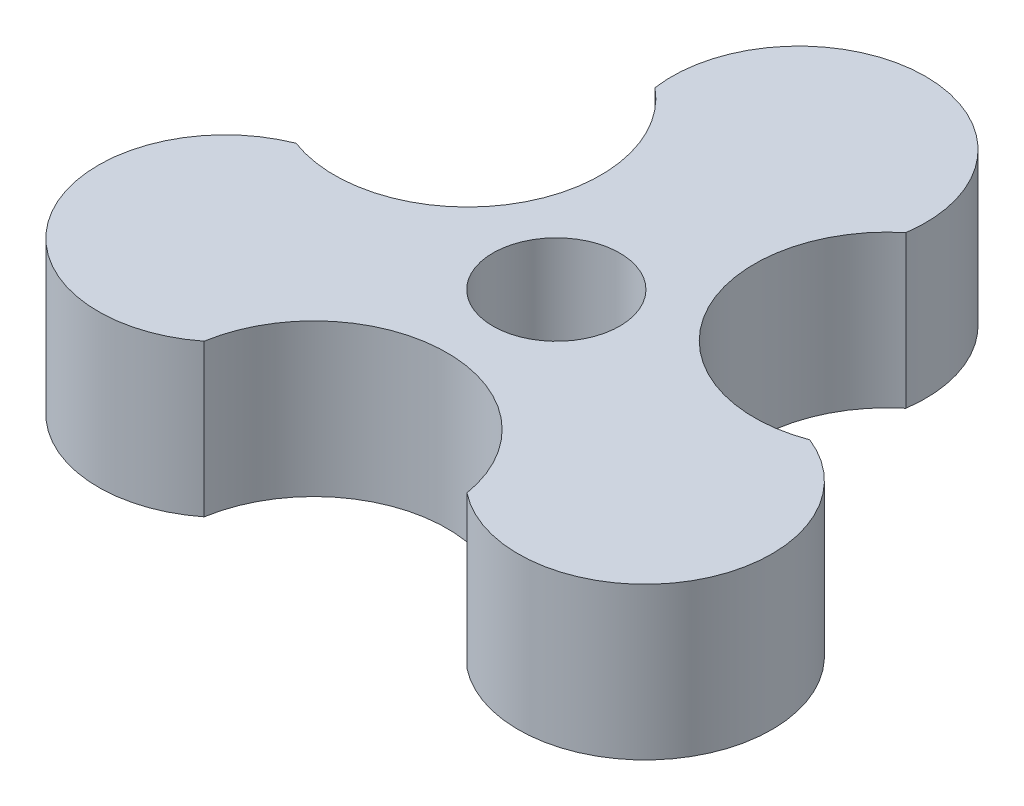
ISO-10303-21;
HEADER;
FILE_DESCRIPTION(('STEP AP214'),'2;1');
FILE_NAME('part.step','',(''),(''),'','','');
FILE_SCHEMA(('AUTOMOTIVE_DESIGN { 1 0 10303 214 1 1 1 1 }'));
ENDSEC;
DATA;
#1=APPLICATION_CONTEXT('core data for automotive mechanical design processes');
#2=APPLICATION_PROTOCOL_DEFINITION('international standard','automotive_design',2000,#1);
#3=PRODUCT_CONTEXT('',#1,'mechanical');
#4=PRODUCT('Part','Part','',(#3));
#5=PRODUCT_RELATED_PRODUCT_CATEGORY('part','',(#4));
#6=PRODUCT_DEFINITION_FORMATION('','',#4);
#7=PRODUCT_DEFINITION_CONTEXT('part definition',#1,'design');
#8=PRODUCT_DEFINITION('design','',#6,#7);
#9=PRODUCT_DEFINITION_SHAPE('','',#8);
#10=(LENGTH_UNIT() NAMED_UNIT(*) SI_UNIT(.MILLI.,.METRE.));
#11=(NAMED_UNIT(*) PLANE_ANGLE_UNIT() SI_UNIT($,.RADIAN.));
#12=(NAMED_UNIT(*) SI_UNIT($,.STERADIAN.) SOLID_ANGLE_UNIT());
#13=UNCERTAINTY_MEASURE_WITH_UNIT(LENGTH_MEASURE(1.E-05),#10,'distance_accuracy_value','');
#14=(GEOMETRIC_REPRESENTATION_CONTEXT(3) GLOBAL_UNCERTAINTY_ASSIGNED_CONTEXT((#13)) GLOBAL_UNIT_ASSIGNED_CONTEXT((#10,
#11,#12)) REPRESENTATION_CONTEXT('',''));
#15=CARTESIAN_POINT('',(0.,0.,0.));
#16=DIRECTION('',(0.,0.,1.));
#17=DIRECTION('',(1.,0.,0.));
#18=AXIS2_PLACEMENT_3D('',#15,#16,#17);
#19=CARTESIAN_POINT('',(8.27920286017928,6.,-4.77999999999992));
#20=DIRECTION('',(0.,-1.,0.));
#21=DIRECTION('',(0.,0.,-1.));
#22=AXIS2_PLACEMENT_3D('',#19,#20,#21);
#23=CYLINDRICAL_SURFACE('',#22,5.25);
#24=CARTESIAN_POINT('',(8.27920286017928,0.,-4.77999999999992));
#25=DIRECTION('',(0.,1.,0.));
#26=DIRECTION('',(0.,0.,1.));
#27=AXIS2_PLACEMENT_3D('',#24,#25,#26);
#28=CIRCLE('',#27,5.25);
#29=CARTESIAN_POINT('',(4.94750579638866,0.,-8.83737534314098));
#30=VERTEX_POINT('',#29);
#31=CARTESIAN_POINT('',(10.1271444481339,0.,0.134021966526863));
#32=VERTEX_POINT('',#31);
#33=EDGE_CURVE('E125',#30,#32,#28,.T.);
#34=ORIENTED_EDGE('',*,*,#33,.F.);
#35=DIRECTION('',(0.,-1.,0.));
#36=VECTOR('',#35,1.);
#37=CARTESIAN_POINT('',(4.94750579638866,6.,-8.83737534314098));
#38=LINE('',#37,#36);
#39=CARTESIAN_POINT('',(4.94750579638866,6.,-8.83737534314098));
#40=VERTEX_POINT('',#39);
#41=EDGE_CURVE('E11',#40,#30,#38,.T.);
#42=ORIENTED_EDGE('',*,*,#41,.F.);
#43=CARTESIAN_POINT('',(8.27920286017928,6.,-4.77999999999992));
#44=DIRECTION('',(0.,1.,0.));
#45=DIRECTION('',(0.,0.,1.));
#46=AXIS2_PLACEMENT_3D('',#43,#44,#45);
#47=CIRCLE('',#46,5.25);
#48=CARTESIAN_POINT('',(10.1271444481339,6.,0.134021966526863));
#49=VERTEX_POINT('',#48);
#50=EDGE_CURVE('E139',#40,#49,#47,.T.);
#51=ORIENTED_EDGE('',*,*,#50,.T.);
#52=DIRECTION('',(0.,-1.,0.));
#53=VECTOR('',#52,1.);
#54=CARTESIAN_POINT('',(10.1271444481339,6.,0.134021966526863));
#55=LINE('',#54,#53);
#56=EDGE_CURVE('E88',#49,#32,#55,.T.);
#57=ORIENTED_EDGE('',*,*,#56,.T.);
#58=EDGE_LOOP('',(#34,#42,#51,#57));
#59=FACE_BOUND('',#58,.T.);
#60=ADVANCED_FACE('F43',(#59),#23,.F.);
#61=CARTESIAN_POINT('',(0.,6.,-9.56));
#62=DIRECTION('',(0.,-1.,0.));
#63=DIRECTION('',(0.,0.,-1.));
#64=AXIS2_PLACEMENT_3D('',#61,#62,#63);
#65=CYLINDRICAL_SURFACE('',#64,5.);
#66=CARTESIAN_POINT('',(0.,0.,-9.56));
#67=DIRECTION('',(0.,1.,0.));
#68=DIRECTION('',(0.,0.,1.));
#69=AXIS2_PLACEMENT_3D('',#66,#67,#68);
#70=CIRCLE('',#69,5.);
#71=CARTESIAN_POINT('',(-4.94750579638869,0.,-8.83737534314117));
#72=VERTEX_POINT('',#71);
#73=EDGE_CURVE('E128',#30,#72,#70,.T.);
#74=ORIENTED_EDGE('',*,*,#73,.T.);
#75=DIRECTION('',(0.,-1.,0.));
#76=VECTOR('',#75,1.);
#77=CARTESIAN_POINT('',(-4.94750579638869,6.,-8.83737534314117));
#78=LINE('',#77,#76);
#79=CARTESIAN_POINT('',(-4.94750579638869,6.,-8.83737534314117));
#80=VERTEX_POINT('',#79);
#81=EDGE_CURVE('E52',#80,#72,#78,.T.);
#82=ORIENTED_EDGE('',*,*,#81,.F.);
#83=CARTESIAN_POINT('',(0.,6.,-9.56));
#84=DIRECTION('',(0.,1.,0.));
#85=DIRECTION('',(0.,0.,1.));
#86=AXIS2_PLACEMENT_3D('',#83,#84,#85);
#87=CIRCLE('',#86,5.);
#88=EDGE_CURVE('E153',#40,#80,#87,.T.);
#89=ORIENTED_EDGE('',*,*,#88,.F.);
#90=ORIENTED_EDGE('',*,*,#41,.T.);
#91=EDGE_LOOP('',(#74,#82,#89,#90));
#92=FACE_BOUND('',#91,.T.);
#93=ADVANCED_FACE('F149',(#92),#65,.T.);
#94=CARTESIAN_POINT('',(-8.27920286017921,6.,-4.78000000000004));
#95=DIRECTION('',(0.,-1.,0.));
#96=DIRECTION('',(0.,0.,-1.));
#97=AXIS2_PLACEMENT_3D('',#94,#95,#96);
#98=CYLINDRICAL_SURFACE('',#97,5.25);
#99=CARTESIAN_POINT('',(-8.27920286017921,0.,-4.78000000000004));
#100=DIRECTION('',(0.,1.,0.));
#101=DIRECTION('',(0.,0.,1.));
#102=AXIS2_PLACEMENT_3D('',#99,#100,#101);
#103=CIRCLE('',#102,5.25);
#104=CARTESIAN_POINT('',(-10.1271444481329,0.,0.134021966527083));
#105=VERTEX_POINT('',#104);
#106=EDGE_CURVE('E131',#105,#72,#103,.T.);
#107=ORIENTED_EDGE('',*,*,#106,.F.);
#108=DIRECTION('',(0.,-1.,0.));
#109=VECTOR('',#108,1.);
#110=CARTESIAN_POINT('',(-10.1271444481329,6.,0.134021966527083));
#111=LINE('',#110,#109);
#112=CARTESIAN_POINT('',(-10.1271444481329,6.,0.134021966527083));
#113=VERTEX_POINT('',#112);
#114=EDGE_CURVE('E118',#113,#105,#111,.T.);
#115=ORIENTED_EDGE('',*,*,#114,.F.);
#116=CARTESIAN_POINT('',(-8.27920286017921,6.,-4.78000000000004));
#117=DIRECTION('',(0.,1.,0.));
#118=DIRECTION('',(0.,0.,1.));
#119=AXIS2_PLACEMENT_3D('',#116,#117,#118);
#120=CIRCLE('',#119,5.25);
#121=EDGE_CURVE('E107',#113,#80,#120,.T.);
#122=ORIENTED_EDGE('',*,*,#121,.T.);
#123=ORIENTED_EDGE('',*,*,#81,.T.);
#124=EDGE_LOOP('',(#107,#115,#122,#123));
#125=FACE_BOUND('',#124,.T.);
#126=ADVANCED_FACE('F146',(#125),#98,.F.);
#127=CARTESIAN_POINT('',(-8.27920286017883,6.,4.78000000000024));
#128=DIRECTION('',(0.,-1.,0.));
#129=DIRECTION('',(0.,0.,-1.));
#130=AXIS2_PLACEMENT_3D('',#127,#128,#129);
#131=CYLINDRICAL_SURFACE('',#130,5.00000000000054);
#132=CARTESIAN_POINT('',(-8.27920286017883,0.,4.78000000000024));
#133=DIRECTION('',(0.,1.,0.));
#134=DIRECTION('',(0.,0.,1.));
#135=AXIS2_PLACEMENT_3D('',#132,#133,#134);
#136=CIRCLE('',#135,5.00000000000054);
#137=CARTESIAN_POINT('',(-5.17963865174432,0.,8.70335337661535));
#138=VERTEX_POINT('',#137);
#139=EDGE_CURVE('E114',#105,#138,#136,.T.);
#140=ORIENTED_EDGE('',*,*,#139,.T.);
#141=DIRECTION('',(0.,-1.,0.));
#142=VECTOR('',#141,1.);
#143=CARTESIAN_POINT('',(-5.17963865174432,6.,8.70335337661535));
#144=LINE('',#143,#142);
#145=CARTESIAN_POINT('',(-5.17963865174432,6.,8.70335337661535));
#146=VERTEX_POINT('',#145);
#147=EDGE_CURVE('E111',#146,#138,#144,.T.);
#148=ORIENTED_EDGE('',*,*,#147,.F.);
#149=CARTESIAN_POINT('',(-8.27920286017883,6.,4.78000000000024));
#150=DIRECTION('',(0.,1.,0.));
#151=DIRECTION('',(0.,0.,1.));
#152=AXIS2_PLACEMENT_3D('',#149,#150,#151);
#153=CIRCLE('',#152,5.00000000000054);
#154=EDGE_CURVE('E101',#113,#146,#153,.T.);
#155=ORIENTED_EDGE('',*,*,#154,.F.);
#156=ORIENTED_EDGE('',*,*,#114,.T.);
#157=EDGE_LOOP('',(#140,#148,#155,#156));
#158=FACE_BOUND('',#157,.T.);
#159=ADVANCED_FACE('F112',(#158),#131,.T.);
#160=CARTESIAN_POINT('',(0.,6.,9.56));
#161=DIRECTION('',(0.,-1.,0.));
#162=DIRECTION('',(0.,0.,-1.));
#163=AXIS2_PLACEMENT_3D('',#160,#161,#162);
#164=CYLINDRICAL_SURFACE('',#163,5.25);
#165=CARTESIAN_POINT('',(0.,0.,9.56));
#166=DIRECTION('',(0.,1.,0.));
#167=DIRECTION('',(0.,0.,1.));
#168=AXIS2_PLACEMENT_3D('',#165,#166,#167);
#169=CIRCLE('',#168,5.25);
#170=CARTESIAN_POINT('',(5.17963865174406,0.,8.7033533766138));
#171=VERTEX_POINT('',#170);
#172=EDGE_CURVE('E135',#171,#138,#169,.T.);
#173=ORIENTED_EDGE('',*,*,#172,.F.);
#174=DIRECTION('',(0.,-1.,0.));
#175=VECTOR('',#174,1.);
#176=CARTESIAN_POINT('',(5.17963865174406,6.,8.7033533766138));
#177=LINE('',#176,#175);
#178=CARTESIAN_POINT('',(5.17963865174406,6.,8.7033533766138));
#179=VERTEX_POINT('',#178);
#180=EDGE_CURVE('E81',#179,#171,#177,.T.);
#181=ORIENTED_EDGE('',*,*,#180,.F.);
#182=CARTESIAN_POINT('',(0.,6.,9.56));
#183=DIRECTION('',(0.,1.,0.));
#184=DIRECTION('',(0.,0.,1.));
#185=AXIS2_PLACEMENT_3D('',#182,#183,#184);
#186=CIRCLE('',#185,5.25);
#187=EDGE_CURVE('E105',#179,#146,#186,.T.);
#188=ORIENTED_EDGE('',*,*,#187,.T.);
#189=ORIENTED_EDGE('',*,*,#147,.T.);
#190=EDGE_LOOP('',(#173,#181,#188,#189));
#191=FACE_BOUND('',#190,.T.);
#192=ADVANCED_FACE('F120',(#191),#164,.F.);
#193=CARTESIAN_POINT('',(8.27920286017964,6.,4.77999999999977));
#194=DIRECTION('',(0.,-1.,0.));
#195=DIRECTION('',(0.,0.,-1.));
#196=AXIS2_PLACEMENT_3D('',#193,#194,#195);
#197=CYLINDRICAL_SURFACE('',#196,5.00000000000036);
#198=CARTESIAN_POINT('',(8.27920286017964,0.,4.77999999999977));
#199=DIRECTION('',(0.,1.,0.));
#200=DIRECTION('',(0.,0.,1.));
#201=AXIS2_PLACEMENT_3D('',#198,#199,#200);
#202=CIRCLE('',#201,5.00000000000036);
#203=EDGE_CURVE('E137',#171,#32,#202,.T.);
#204=ORIENTED_EDGE('',*,*,#203,.T.);
#205=ORIENTED_EDGE('',*,*,#56,.F.);
#206=CARTESIAN_POINT('',(8.27920286017964,6.,4.77999999999977));
#207=DIRECTION('',(0.,1.,0.));
#208=DIRECTION('',(0.,0.,1.));
#209=AXIS2_PLACEMENT_3D('',#206,#207,#208);
#210=CIRCLE('',#209,5.00000000000036);
#211=EDGE_CURVE('E60',#179,#49,#210,.T.);
#212=ORIENTED_EDGE('',*,*,#211,.F.);
#213=ORIENTED_EDGE('',*,*,#180,.T.);
#214=EDGE_LOOP('',(#204,#205,#212,#213));
#215=FACE_BOUND('',#214,.T.);
#216=ADVANCED_FACE('F152',(#215),#197,.T.);
#217=CARTESIAN_POINT('',(0.,6.,0.));
#218=DIRECTION('',(0.,1.,0.));
#219=DIRECTION('',(0.,0.,1.));
#220=AXIS2_PLACEMENT_3D('',#217,#218,#219);
#221=PLANE('',#220);
#222=CARTESIAN_POINT('',(0.,6.,0.));
#223=DIRECTION('',(0.,1.,0.));
#224=DIRECTION('',(0.,0.,1.));
#225=AXIS2_PLACEMENT_3D('',#222,#223,#224);
#226=CIRCLE('',#225,2.5);
#227=CARTESIAN_POINT('',(0.,6.,2.5));
#228=VERTEX_POINT('',#227);
#229=EDGE_CURVE('E157',#228,#228,#226,.T.);
#230=ORIENTED_EDGE('',*,*,#229,.F.);
#231=EDGE_LOOP('',(#230));
#232=FACE_BOUND('',#231,.T.);
#233=ORIENTED_EDGE('',*,*,#50,.F.);
#234=ORIENTED_EDGE('',*,*,#88,.T.);
#235=ORIENTED_EDGE('',*,*,#121,.F.);
#236=ORIENTED_EDGE('',*,*,#154,.T.);
#237=ORIENTED_EDGE('',*,*,#187,.F.);
#238=ORIENTED_EDGE('',*,*,#211,.T.);
#239=EDGE_LOOP('',(#233,#234,#235,#236,#237,#238));
#240=FACE_BOUND('',#239,.T.);
#241=ADVANCED_FACE('F103',(#232,#240),#221,.T.);
#242=CARTESIAN_POINT('',(0.,0.,0.));
#243=DIRECTION('',(0.,1.,0.));
#244=DIRECTION('',(0.,0.,1.));
#245=AXIS2_PLACEMENT_3D('',#242,#243,#244);
#246=PLANE('',#245);
#247=CARTESIAN_POINT('',(0.,0.,0.));
#248=DIRECTION('',(0.,1.,0.));
#249=DIRECTION('',(0.,0.,1.));
#250=AXIS2_PLACEMENT_3D('',#247,#248,#249);
#251=CIRCLE('',#250,2.5);
#252=CARTESIAN_POINT('',(0.,0.,2.5));
#253=VERTEX_POINT('',#252);
#254=EDGE_CURVE('E46',#253,#253,#251,.T.);
#255=ORIENTED_EDGE('',*,*,#254,.T.);
#256=EDGE_LOOP('',(#255));
#257=FACE_BOUND('',#256,.T.);
#258=ORIENTED_EDGE('',*,*,#33,.T.);
#259=ORIENTED_EDGE('',*,*,#203,.F.);
#260=ORIENTED_EDGE('',*,*,#172,.T.);
#261=ORIENTED_EDGE('',*,*,#139,.F.);
#262=ORIENTED_EDGE('',*,*,#106,.T.);
#263=ORIENTED_EDGE('',*,*,#73,.F.);
#264=EDGE_LOOP('',(#258,#259,#260,#261,#262,#263));
#265=FACE_BOUND('',#264,.T.);
#266=ADVANCED_FACE('F151',(#257,#265),#246,.F.);
#267=CARTESIAN_POINT('',(0.,-2.,0.));
#268=DIRECTION('',(0.,1.,0.));
#269=DIRECTION('',(0.,0.,1.));
#270=AXIS2_PLACEMENT_3D('',#267,#268,#269);
#271=CYLINDRICAL_SURFACE('',#270,2.5);
#272=ORIENTED_EDGE('',*,*,#229,.T.);
#273=EDGE_LOOP('',(#272));
#274=FACE_BOUND('',#273,.T.);
#275=ORIENTED_EDGE('',*,*,#254,.F.);
#276=EDGE_LOOP('',(#275));
#277=FACE_BOUND('',#276,.T.);
#278=ADVANCED_FACE('F165',(#274,#277),#271,.F.);
#279=CLOSED_SHELL('',(#60,#93,#126,#159,#192,#216,#241,#266,#278));
#280=MANIFOLD_SOLID_BREP('B2',#279);
#281=ADVANCED_BREP_SHAPE_REPRESENTATION('',(#18,#280),#14);
#282=SHAPE_DEFINITION_REPRESENTATION(#9,#281);
ENDSEC;
END-ISO-10303-21;
